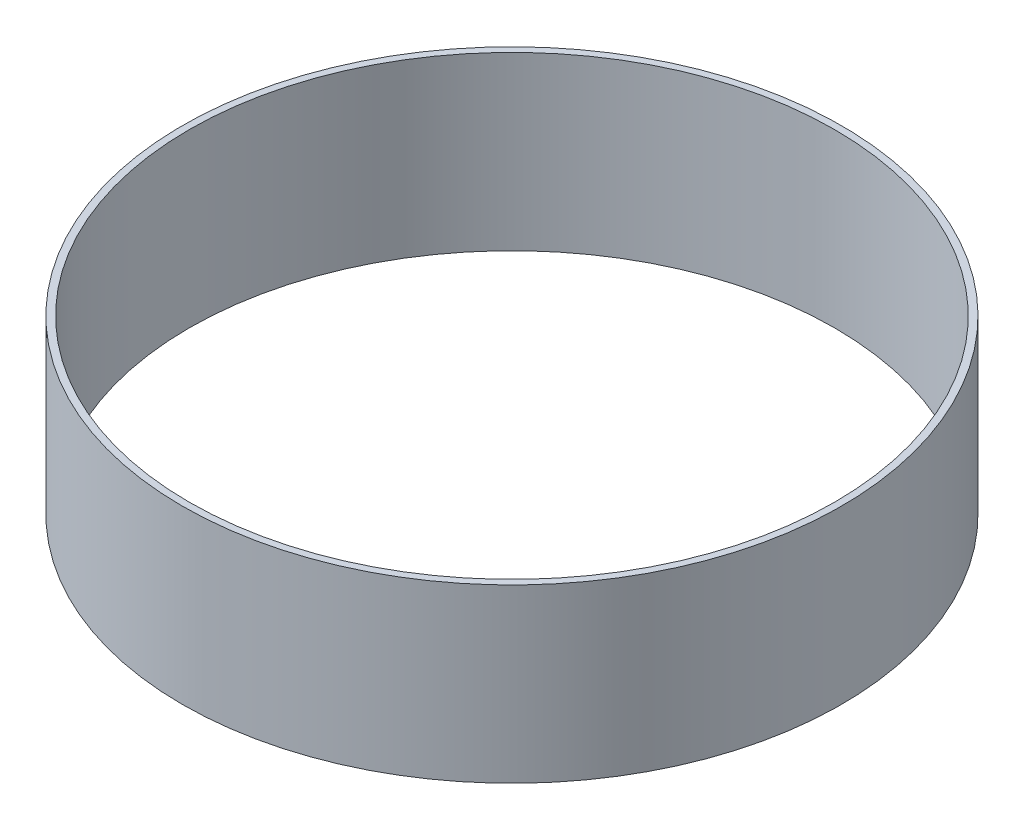
ISO-10303-21;
HEADER;
FILE_DESCRIPTION(('STEP AP214'),'2;1');
FILE_NAME('part.step','',(''),(''),'','','');
FILE_SCHEMA(('AUTOMOTIVE_DESIGN { 1 0 10303 214 1 1 1 1 }'));
ENDSEC;
DATA;
#1=APPLICATION_CONTEXT('core data for automotive mechanical design processes');
#2=APPLICATION_PROTOCOL_DEFINITION('international standard','automotive_design',2000,#1);
#3=PRODUCT_CONTEXT('',#1,'mechanical');
#4=PRODUCT('Part','Part','',(#3));
#5=PRODUCT_RELATED_PRODUCT_CATEGORY('part','',(#4));
#6=PRODUCT_DEFINITION_FORMATION('','',#4);
#7=PRODUCT_DEFINITION_CONTEXT('part definition',#1,'design');
#8=PRODUCT_DEFINITION('design','',#6,#7);
#9=PRODUCT_DEFINITION_SHAPE('','',#8);
#10=(LENGTH_UNIT() NAMED_UNIT(*) SI_UNIT(.MILLI.,.METRE.));
#11=(NAMED_UNIT(*) PLANE_ANGLE_UNIT() SI_UNIT($,.RADIAN.));
#12=(NAMED_UNIT(*) SI_UNIT($,.STERADIAN.) SOLID_ANGLE_UNIT());
#13=UNCERTAINTY_MEASURE_WITH_UNIT(LENGTH_MEASURE(1.E-05),#10,'distance_accuracy_value','');
#14=(GEOMETRIC_REPRESENTATION_CONTEXT(3) GLOBAL_UNCERTAINTY_ASSIGNED_CONTEXT((#13)) GLOBAL_UNIT_ASSIGNED_CONTEXT((#10,
#11,#12)) REPRESENTATION_CONTEXT('',''));
#15=CARTESIAN_POINT('',(0.,0.,0.));
#16=DIRECTION('',(0.,0.,1.));
#17=DIRECTION('',(1.,0.,0.));
#18=AXIS2_PLACEMENT_3D('',#15,#16,#17);
#19=CARTESIAN_POINT('',(0.,50.8,0.));
#20=DIRECTION('',(0.,1.,0.));
#21=DIRECTION('',(0.,0.,1.));
#22=AXIS2_PLACEMENT_3D('',#19,#20,#21);
#23=PLANE('',#22);
#24=CARTESIAN_POINT('',(0.,50.8,0.));
#25=DIRECTION('',(0.,1.,0.));
#26=DIRECTION('',(0.,0.,1.));
#27=AXIS2_PLACEMENT_3D('',#24,#25,#26);
#28=CIRCLE('',#27,97.4725);
#29=CARTESIAN_POINT('',(0.,50.8,97.4725));
#30=VERTEX_POINT('',#29);
#31=EDGE_CURVE('E10',#30,#30,#28,.T.);
#32=ORIENTED_EDGE('',*,*,#31,.T.);
#33=EDGE_LOOP('',(#32));
#34=FACE_BOUND('',#33,.T.);
#35=CARTESIAN_POINT('',(0.,50.8,0.));
#36=DIRECTION('',(0.,1.,0.));
#37=DIRECTION('',(0.,0.,1.));
#38=AXIS2_PLACEMENT_3D('',#35,#36,#37);
#39=CIRCLE('',#38,95.4405);
#40=CARTESIAN_POINT('',(0.,50.8,95.4405));
#41=VERTEX_POINT('',#40);
#42=EDGE_CURVE('E42',#41,#41,#39,.T.);
#43=ORIENTED_EDGE('',*,*,#42,.F.);
#44=EDGE_LOOP('',(#43));
#45=FACE_BOUND('',#44,.T.);
#46=ADVANCED_FACE('F31',(#34,#45),#23,.T.);
#47=CARTESIAN_POINT('',(0.,0.,0.));
#48=DIRECTION('',(0.,1.,0.));
#49=DIRECTION('',(0.,0.,1.));
#50=AXIS2_PLACEMENT_3D('',#47,#48,#49);
#51=PLANE('',#50);
#52=CARTESIAN_POINT('',(0.,0.,0.));
#53=DIRECTION('',(0.,1.,0.));
#54=DIRECTION('',(0.,0.,1.));
#55=AXIS2_PLACEMENT_3D('',#52,#53,#54);
#56=CIRCLE('',#55,97.4725);
#57=CARTESIAN_POINT('',(0.,0.,97.4725));
#58=VERTEX_POINT('',#57);
#59=EDGE_CURVE('E35',#58,#58,#56,.T.);
#60=ORIENTED_EDGE('',*,*,#59,.F.);
#61=EDGE_LOOP('',(#60));
#62=FACE_BOUND('',#61,.T.);
#63=CARTESIAN_POINT('',(0.,0.,0.));
#64=DIRECTION('',(0.,1.,0.));
#65=DIRECTION('',(0.,0.,1.));
#66=AXIS2_PLACEMENT_3D('',#63,#64,#65);
#67=CIRCLE('',#66,95.4405);
#68=CARTESIAN_POINT('',(0.,0.,95.4405));
#69=VERTEX_POINT('',#68);
#70=EDGE_CURVE('E44',#69,#69,#67,.T.);
#71=ORIENTED_EDGE('',*,*,#70,.T.);
#72=EDGE_LOOP('',(#71));
#73=FACE_BOUND('',#72,.T.);
#74=ADVANCED_FACE('F54',(#62,#73),#51,.F.);
#75=CARTESIAN_POINT('',(0.,50.8,0.));
#76=DIRECTION('',(0.,-1.,0.));
#77=DIRECTION('',(0.,0.,-1.));
#78=AXIS2_PLACEMENT_3D('',#75,#76,#77);
#79=CYLINDRICAL_SURFACE('',#78,97.4725);
#80=ORIENTED_EDGE('',*,*,#31,.F.);
#81=EDGE_LOOP('',(#80));
#82=FACE_BOUND('',#81,.T.);
#83=ORIENTED_EDGE('',*,*,#59,.T.);
#84=EDGE_LOOP('',(#83));
#85=FACE_BOUND('',#84,.T.);
#86=ADVANCED_FACE('F33',(#82,#85),#79,.T.);
#87=CARTESIAN_POINT('',(0.,50.8,0.));
#88=DIRECTION('',(0.,-1.,0.));
#89=DIRECTION('',(0.,0.,-1.));
#90=AXIS2_PLACEMENT_3D('',#87,#88,#89);
#91=CYLINDRICAL_SURFACE('',#90,95.4405);
#92=ORIENTED_EDGE('',*,*,#42,.T.);
#93=EDGE_LOOP('',(#92));
#94=FACE_BOUND('',#93,.T.);
#95=ORIENTED_EDGE('',*,*,#70,.F.);
#96=EDGE_LOOP('',(#95));
#97=FACE_BOUND('',#96,.T.);
#98=ADVANCED_FACE('F50',(#94,#97),#91,.F.);
#99=CLOSED_SHELL('',(#46,#74,#86,#98));
#100=MANIFOLD_SOLID_BREP('B2',#99);
#101=ADVANCED_BREP_SHAPE_REPRESENTATION('',(#18,#100),#14);
#102=SHAPE_DEFINITION_REPRESENTATION(#9,#101);
ENDSEC;
END-ISO-10303-21;
